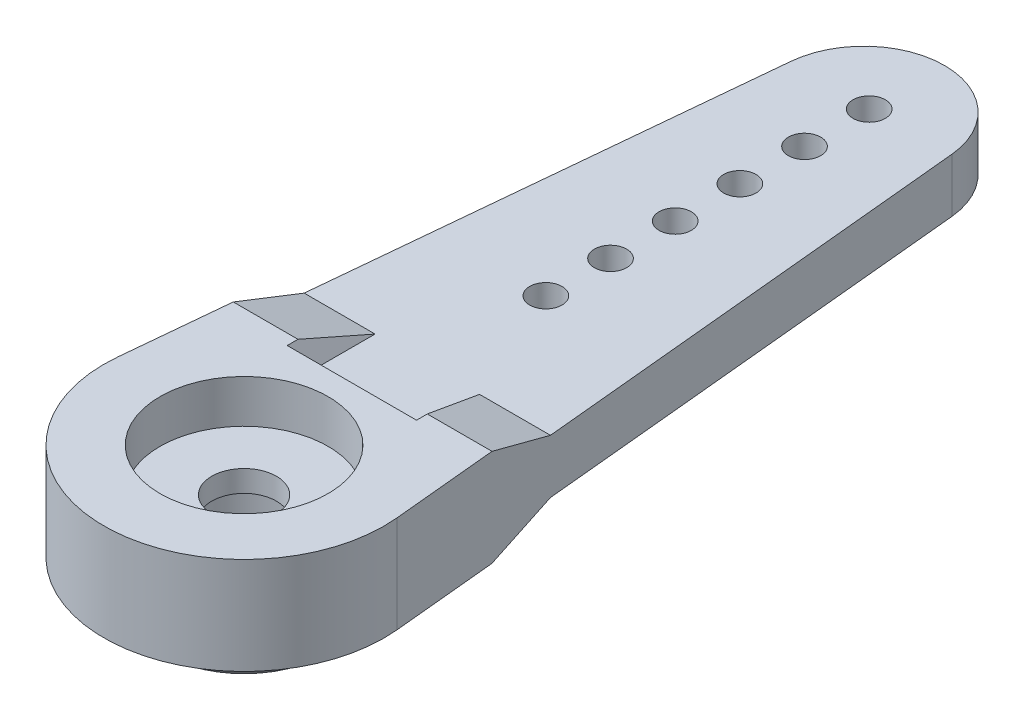
ISO-10303-21;
HEADER;
FILE_DESCRIPTION(('STEP AP214'),'2;1');
FILE_NAME('part.step','',(''),(''),'','','');
FILE_SCHEMA(('AUTOMOTIVE_DESIGN { 1 0 10303 214 1 1 1 1 }'));
ENDSEC;
DATA;
#1=APPLICATION_CONTEXT('core data for automotive mechanical design processes');
#2=APPLICATION_PROTOCOL_DEFINITION('international standard','automotive_design',2000,#1);
#3=PRODUCT_CONTEXT('',#1,'mechanical');
#4=PRODUCT('Part','Part','',(#3));
#5=PRODUCT_RELATED_PRODUCT_CATEGORY('part','',(#4));
#6=PRODUCT_DEFINITION_FORMATION('','',#4);
#7=PRODUCT_DEFINITION_CONTEXT('part definition',#1,'design');
#8=PRODUCT_DEFINITION('design','',#6,#7);
#9=PRODUCT_DEFINITION_SHAPE('','',#8);
#10=(LENGTH_UNIT() NAMED_UNIT(*) SI_UNIT(.MILLI.,.METRE.));
#11=(NAMED_UNIT(*) PLANE_ANGLE_UNIT() SI_UNIT($,.RADIAN.));
#12=(NAMED_UNIT(*) SI_UNIT($,.STERADIAN.) SOLID_ANGLE_UNIT());
#13=UNCERTAINTY_MEASURE_WITH_UNIT(LENGTH_MEASURE(1.E-05),#10,'distance_accuracy_value','');
#14=(GEOMETRIC_REPRESENTATION_CONTEXT(3) GLOBAL_UNCERTAINTY_ASSIGNED_CONTEXT((#13)) GLOBAL_UNIT_ASSIGNED_CONTEXT((#10,
#11,#12)) REPRESENTATION_CONTEXT('',''));
#15=CARTESIAN_POINT('',(0.,0.,0.));
#16=DIRECTION('',(0.,0.,1.));
#17=DIRECTION('',(1.,0.,0.));
#18=AXIS2_PLACEMENT_3D('',#15,#16,#17);
#19=CARTESIAN_POINT('',(0.,-2.25,0.));
#20=DIRECTION('',(0.,1.,0.));
#21=DIRECTION('',(0.,0.,1.));
#22=AXIS2_PLACEMENT_3D('',#19,#20,#21);
#23=PLANE('',#22);
#24=DIRECTION('',(0.,0.,1.));
#25=VECTOR('',#24,1.);
#26=CARTESIAN_POINT('',(-3.,-2.25,-5.));
#27=LINE('',#26,#25);
#28=CARTESIAN_POINT('',(-3.,-2.25,-5.5));
#29=VERTEX_POINT('',#28);
#30=CARTESIAN_POINT('',(-3.,-2.25,-5.));
#31=VERTEX_POINT('',#30);
#32=EDGE_CURVE('E183',#29,#31,#27,.T.);
#33=ORIENTED_EDGE('',*,*,#32,.T.);
#34=DIRECTION('',(1.,0.,0.));
#35=VECTOR('',#34,1.);
#36=CARTESIAN_POINT('',(-3.,-2.25,-5.));
#37=LINE('',#36,#35);
#38=CARTESIAN_POINT('',(3.,-2.25,-5.));
#39=VERTEX_POINT('',#38);
#40=EDGE_CURVE('E182',#31,#39,#37,.T.);
#41=ORIENTED_EDGE('',*,*,#40,.T.);
#42=DIRECTION('',(0.,0.,-1.));
#43=VECTOR('',#42,1.);
#44=CARTESIAN_POINT('',(3.,-2.25,-5.));
#45=LINE('',#44,#43);
#46=CARTESIAN_POINT('',(3.,-2.25,-5.5));
#47=VERTEX_POINT('',#46);
#48=EDGE_CURVE('E186',#39,#47,#45,.T.);
#49=ORIENTED_EDGE('',*,*,#48,.T.);
#50=DIRECTION('',(1.,0.,0.));
#51=VECTOR('',#50,1.);
#52=CARTESIAN_POINT('',(-7.,-2.25,-5.5));
#53=LINE('',#52,#51);
#54=CARTESIAN_POINT('',(6.00143069023298,-2.25,-5.49999999999999));
#55=VERTEX_POINT('',#54);
#56=EDGE_CURVE('E197',#47,#55,#53,.T.);
#57=ORIENTED_EDGE('',*,*,#56,.T.);
#58=DIRECTION('',(-0.0956521739130435,0.,-0.995414818869856));
#59=VECTOR('',#58,1.);
#60=CARTESIAN_POINT('',(3.73280557076196,-2.25,-29.1086956521739));
#61=LINE('',#60,#59);
#62=CARTESIAN_POINT('',(6.47019632265407,-2.25,-0.621739130434783));
#63=VERTEX_POINT('',#62);
#64=EDGE_CURVE('E376',#63,#55,#61,.T.);
#65=ORIENTED_EDGE('',*,*,#64,.F.);
#66=CARTESIAN_POINT('',(0.,-2.25,0.));
#67=DIRECTION('',(0.,1.,0.));
#68=DIRECTION('',(0.,0.,1.));
#69=AXIS2_PLACEMENT_3D('',#66,#67,#68);
#70=CIRCLE('',#69,6.5);
#71=CARTESIAN_POINT('',(-6.47019632265407,-2.25,-0.621739130434783));
#72=VERTEX_POINT('',#71);
#73=EDGE_CURVE('E363',#72,#63,#70,.T.);
#74=ORIENTED_EDGE('',*,*,#73,.F.);
#75=DIRECTION('',(-0.0956521739130435,0.,0.995414818869856));
#76=VECTOR('',#75,1.);
#77=CARTESIAN_POINT('',(-6.47019632265407,-2.25,-0.621739130434783));
#78=LINE('',#77,#76);
#79=CARTESIAN_POINT('',(-6.00143069023298,-2.25,-5.5));
#80=VERTEX_POINT('',#79);
#81=EDGE_CURVE('E368',#80,#72,#78,.T.);
#82=ORIENTED_EDGE('',*,*,#81,.F.);
#83=EDGE_CURVE('E297',#80,#29,#53,.T.);
#84=ORIENTED_EDGE('',*,*,#83,.T.);
#85=EDGE_LOOP('',(#33,#41,#49,#57,#65,#74,#82,#84));
#86=FACE_BOUND('',#85,.T.);
#87=CARTESIAN_POINT('',(0.,-2.25,0.));
#88=DIRECTION('',(0.,1.,0.));
#89=DIRECTION('',(0.,0.,1.));
#90=AXIS2_PLACEMENT_3D('',#87,#88,#89);
#91=CIRCLE('',#90,4.8);
#92=CARTESIAN_POINT('',(0.,-2.25,4.8));
#93=VERTEX_POINT('',#92);
#94=EDGE_CURVE('E192',#93,#93,#91,.F.);
#95=ORIENTED_EDGE('',*,*,#94,.F.);
#96=EDGE_LOOP('',(#95));
#97=FACE_BOUND('',#96,.T.);
#98=ADVANCED_FACE('F33',(#86,#97),#23,.F.);
#99=CARTESIAN_POINT('',(-7.,-1.25,-8.5));
#100=DIRECTION('',(0.,-0.948683298050514,-0.316227766016838));
#101=DIRECTION('',(0.,0.316227766016838,-0.948683298050514));
#102=AXIS2_PLACEMENT_3D('',#99,#100,#101);
#103=PLANE('',#102);
#104=DIRECTION('',(1.,0.,0.));
#105=VECTOR('',#104,1.);
#106=CARTESIAN_POINT('',(-7.,-1.25,-8.5));
#107=LINE('',#106,#105);
#108=CARTESIAN_POINT('',(-5.71315236013446,-1.25,-8.5));
#109=VERTEX_POINT('',#108);
#110=CARTESIAN_POINT('',(-2.42264973081037,-1.25,-8.5));
#111=VERTEX_POINT('',#110);
#112=EDGE_CURVE('E292',#109,#111,#107,.T.);
#113=ORIENTED_EDGE('',*,*,#112,.T.);
#114=DIRECTION('',(-0.179605302026775,-0.311085508419127,0.933256525257383));
#115=VECTOR('',#114,1.);
#116=CARTESIAN_POINT('',(-2.57030619110681,-1.50574849129921,-7.73275452610237));
#117=LINE('',#116,#115);
#118=EDGE_CURVE('E189',#111,#29,#117,.T.);
#119=ORIENTED_EDGE('',*,*,#118,.T.);
#120=ORIENTED_EDGE('',*,*,#83,.F.);
#121=DIRECTION('',(0.0907851605251029,0.314921903752094,-0.944765711256282));
#122=VECTOR('',#121,1.);
#123=CARTESIAN_POINT('',(-6.29505005335289,-3.26852734827328,-2.44441795518016));
#124=LINE('',#123,#122);
#125=EDGE_CURVE('E179',#80,#109,#124,.T.);
#126=ORIENTED_EDGE('',*,*,#125,.T.);
#127=EDGE_LOOP('',(#113,#119,#120,#126));
#128=FACE_BOUND('',#127,.T.);
#129=ADVANCED_FACE('F221',(#128),#103,.T.);
#130=ORIENTED_EDGE('',*,*,#56,.F.);
#131=DIRECTION('',(-0.179605302026775,0.311085508419127,-0.933256525257383));
#132=VECTOR('',#131,1.);
#133=CARTESIAN_POINT('',(2.11869328788101,-0.723531997558427,-10.0794040073247));
#134=LINE('',#133,#132);
#135=CARTESIAN_POINT('',(2.42264973081037,-1.25,-8.5));
#136=VERTEX_POINT('',#135);
#137=EDGE_CURVE('E193',#47,#136,#134,.T.);
#138=ORIENTED_EDGE('',*,*,#137,.T.);
#139=CARTESIAN_POINT('',(5.71315236013445,-1.25,-8.5));
#140=VERTEX_POINT('',#139);
#141=EDGE_CURVE('E296',#136,#140,#107,.T.);
#142=ORIENTED_EDGE('',*,*,#141,.T.);
#143=DIRECTION('',(0.0907851605251029,-0.314921903752094,0.944765711256282));
#144=VECTOR('',#143,1.);
#145=CARTESIAN_POINT('',(3.82914223414622,5.28538587289693,-28.1061576186908));
#146=LINE('',#145,#144);
#147=EDGE_CURVE('E322',#140,#55,#146,.T.);
#148=ORIENTED_EDGE('',*,*,#147,.T.);
#149=EDGE_LOOP('',(#130,#138,#142,#148));
#150=FACE_BOUND('',#149,.T.);
#151=ADVANCED_FACE('F227',(#150),#103,.T.);
#152=CARTESIAN_POINT('',(3.73280557076196,2.25,-29.1086956521739));
#153=DIRECTION('',(-0.995414818869856,0.,0.0956521739130435));
#154=DIRECTION('',(0.0956521739130435,0.,0.995414818869856));
#155=AXIS2_PLACEMENT_3D('',#152,#153,#154);
#156=PLANE('',#155);
#157=ORIENTED_EDGE('',*,*,#147,.F.);
#158=DIRECTION('',(0.0956521739130435,0.,0.995414818869856));
#159=VECTOR('',#158,1.);
#160=CARTESIAN_POINT('',(3.73280557076196,-1.25,-29.1086956521739));
#161=LINE('',#160,#159);
#162=CARTESIAN_POINT('',(3.73280557076196,-1.25,-29.1086956521739));
#163=VERTEX_POINT('',#162);
#164=EDGE_CURVE('E319',#163,#140,#161,.T.);
#165=ORIENTED_EDGE('',*,*,#164,.F.);
#166=DIRECTION('',(0.,-1.,0.));
#167=VECTOR('',#166,1.);
#168=CARTESIAN_POINT('',(3.73280557076196,2.25,-29.1086956521739));
#169=LINE('',#168,#167);
#170=CARTESIAN_POINT('',(3.73280557076196,1.25,-29.1086956521739));
#171=VERTEX_POINT('',#170);
#172=EDGE_CURVE('E385',#171,#163,#169,.T.);
#173=ORIENTED_EDGE('',*,*,#172,.F.);
#174=DIRECTION('',(0.0956521739130435,0.,0.995414818869856));
#175=VECTOR('',#174,1.);
#176=CARTESIAN_POINT('',(3.73280557076196,1.25,-29.1086956521739));
#177=LINE('',#176,#175);
#178=CARTESIAN_POINT('',(5.71315236013445,1.25,-8.5));
#179=VERTEX_POINT('',#178);
#180=EDGE_CURVE('E357',#171,#179,#177,.T.);
#181=ORIENTED_EDGE('',*,*,#180,.T.);
#182=DIRECTION('',(0.0907851605251029,0.314921903752094,0.944765711256282));
#183=VECTOR('',#182,1.);
#184=CARTESIAN_POINT('',(3.95779829427874,-4.83909474831414,-26.7672842449425));
#185=LINE('',#184,#183);
#186=CARTESIAN_POINT('',(6.00143069023298,2.25,-5.49999999999999));
#187=VERTEX_POINT('',#186);
#188=EDGE_CURVE('E360',#179,#187,#185,.T.);
#189=ORIENTED_EDGE('',*,*,#188,.T.);
#190=DIRECTION('',(-0.0956521739130435,0.,-0.995414818869856));
#191=VECTOR('',#190,1.);
#192=CARTESIAN_POINT('',(3.73280557076196,2.25,-29.1086956521739));
#193=LINE('',#192,#191);
#194=CARTESIAN_POINT('',(6.47019632265407,2.25,-0.621739130434783));
#195=VERTEX_POINT('',#194);
#196=EDGE_CURVE('E367',#195,#187,#193,.T.);
#197=ORIENTED_EDGE('',*,*,#196,.F.);
#198=DIRECTION('',(0.,-1.,0.));
#199=VECTOR('',#198,1.);
#200=CARTESIAN_POINT('',(6.47019632265407,2.25,-0.621739130434783));
#201=LINE('',#200,#199);
#202=EDGE_CURVE('E388',#195,#63,#201,.T.);
#203=ORIENTED_EDGE('',*,*,#202,.T.);
#204=ORIENTED_EDGE('',*,*,#64,.T.);
#205=EDGE_LOOP('',(#157,#165,#173,#181,#189,#197,#203,#204));
#206=FACE_BOUND('',#205,.T.);
#207=ADVANCED_FACE('F244',(#206),#156,.F.);
#208=CARTESIAN_POINT('',(0.,2.25,-28.75));
#209=DIRECTION('',(0.,-1.,0.));
#210=DIRECTION('',(0.,0.,-1.));
#211=AXIS2_PLACEMENT_3D('',#208,#209,#210);
#212=CYLINDRICAL_SURFACE('',#211,3.75);
#213=CARTESIAN_POINT('',(0.,-1.25,-28.75));
#214=DIRECTION('',(0.,-1.,0.));
#215=DIRECTION('',(0.,0.,-1.));
#216=AXIS2_PLACEMENT_3D('',#213,#214,#215);
#217=CIRCLE('',#216,3.75);
#218=CARTESIAN_POINT('',(-3.73280557076196,-1.25,-29.1086956521739));
#219=VERTEX_POINT('',#218);
#220=EDGE_CURVE('E317',#219,#163,#217,.T.);
#221=ORIENTED_EDGE('',*,*,#220,.F.);
#222=DIRECTION('',(0.,-1.,0.));
#223=VECTOR('',#222,1.);
#224=CARTESIAN_POINT('',(-3.73280557076196,2.25,-29.1086956521739));
#225=LINE('',#224,#223);
#226=CARTESIAN_POINT('',(-3.73280557076196,1.25,-29.1086956521739));
#227=VERTEX_POINT('',#226);
#228=EDGE_CURVE('E382',#227,#219,#225,.T.);
#229=ORIENTED_EDGE('',*,*,#228,.F.);
#230=CARTESIAN_POINT('',(0.,1.25,-28.75));
#231=DIRECTION('',(0.,-1.,0.));
#232=DIRECTION('',(0.,0.,-1.));
#233=AXIS2_PLACEMENT_3D('',#230,#231,#232);
#234=CIRCLE('',#233,3.75);
#235=EDGE_CURVE('E354',#227,#171,#234,.T.);
#236=ORIENTED_EDGE('',*,*,#235,.T.);
#237=ORIENTED_EDGE('',*,*,#172,.T.);
#238=EDGE_LOOP('',(#221,#229,#236,#237));
#239=FACE_BOUND('',#238,.T.);
#240=ADVANCED_FACE('F240',(#239),#212,.T.);
#241=CARTESIAN_POINT('',(-6.47019632265407,2.25,-0.621739130434783));
#242=DIRECTION('',(0.995414818869856,0.,0.0956521739130435));
#243=DIRECTION('',(0.0956521739130435,0.,-0.995414818869856));
#244=AXIS2_PLACEMENT_3D('',#241,#242,#243);
#245=PLANE('',#244);
#246=ORIENTED_EDGE('',*,*,#125,.F.);
#247=ORIENTED_EDGE('',*,*,#81,.T.);
#248=DIRECTION('',(0.,-1.,0.));
#249=VECTOR('',#248,1.);
#250=CARTESIAN_POINT('',(-6.47019632265407,2.25,-0.621739130434783));
#251=LINE('',#250,#249);
#252=CARTESIAN_POINT('',(-6.47019632265407,2.25,-0.621739130434783));
#253=VERTEX_POINT('',#252);
#254=EDGE_CURVE('E373',#253,#72,#251,.T.);
#255=ORIENTED_EDGE('',*,*,#254,.F.);
#256=DIRECTION('',(-0.0956521739130435,0.,0.995414818869856));
#257=VECTOR('',#256,1.);
#258=CARTESIAN_POINT('',(-6.47019632265407,2.25,-0.621739130434783));
#259=LINE('',#258,#257);
#260=CARTESIAN_POINT('',(-6.00143069023298,2.25,-5.5));
#261=VERTEX_POINT('',#260);
#262=EDGE_CURVE('E371',#261,#253,#259,.T.);
#263=ORIENTED_EDGE('',*,*,#262,.F.);
#264=DIRECTION('',(0.0907851605251029,-0.314921903752094,-0.944765711256282));
#265=VECTOR('',#264,1.);
#266=CARTESIAN_POINT('',(-6.42370611348541,3.71481847285607,-1.10554458143178));
#267=LINE('',#266,#265);
#268=CARTESIAN_POINT('',(-5.71315236013446,1.25,-8.5));
#269=VERTEX_POINT('',#268);
#270=EDGE_CURVE('E391',#261,#269,#267,.T.);
#271=ORIENTED_EDGE('',*,*,#270,.T.);
#272=DIRECTION('',(0.0956521739130435,0.,-0.995414818869856));
#273=VECTOR('',#272,1.);
#274=CARTESIAN_POINT('',(-6.47019632265407,1.25,-0.621739130434783));
#275=LINE('',#274,#273);
#276=EDGE_CURVE('E351',#269,#227,#275,.T.);
#277=ORIENTED_EDGE('',*,*,#276,.T.);
#278=ORIENTED_EDGE('',*,*,#228,.T.);
#279=DIRECTION('',(0.0956521739130435,0.,-0.995414818869856));
#280=VECTOR('',#279,1.);
#281=CARTESIAN_POINT('',(-6.47019632265407,-1.25,-0.621739130434782));
#282=LINE('',#281,#280);
#283=EDGE_CURVE('E314',#109,#219,#282,.T.);
#284=ORIENTED_EDGE('',*,*,#283,.F.);
#285=EDGE_LOOP('',(#246,#247,#255,#263,#271,#277,#278,#284));
#286=FACE_BOUND('',#285,.T.);
#287=ADVANCED_FACE('F236',(#286),#245,.F.);
#288=CARTESIAN_POINT('',(0.,2.25,-29.));
#289=DIRECTION('',(0.,-1.,0.));
#290=DIRECTION('',(0.,0.,-1.));
#291=AXIS2_PLACEMENT_3D('',#288,#289,#290);
#292=CYLINDRICAL_SURFACE('',#291,0.750000000000001);
#293=CARTESIAN_POINT('',(0.,1.25,-29.));
#294=DIRECTION('',(0.,-1.,0.));
#295=DIRECTION('',(0.,0.,-1.));
#296=AXIS2_PLACEMENT_3D('',#293,#294,#295);
#297=CIRCLE('',#296,0.750000000000001);
#298=CARTESIAN_POINT('',(0.,1.25,-29.75));
#299=VERTEX_POINT('',#298);
#300=EDGE_CURVE('E348',#299,#299,#297,.T.);
#301=ORIENTED_EDGE('',*,*,#300,.F.);
#302=EDGE_LOOP('',(#301));
#303=FACE_BOUND('',#302,.T.);
#304=CARTESIAN_POINT('',(0.,-1.25,-29.));
#305=DIRECTION('',(0.,-1.,0.));
#306=DIRECTION('',(0.,0.,-1.));
#307=AXIS2_PLACEMENT_3D('',#304,#305,#306);
#308=CIRCLE('',#307,0.750000000000001);
#309=CARTESIAN_POINT('',(0.,-1.25,-29.75));
#310=VERTEX_POINT('',#309);
#311=EDGE_CURVE('E311',#310,#310,#308,.T.);
#312=ORIENTED_EDGE('',*,*,#311,.T.);
#313=EDGE_LOOP('',(#312));
#314=FACE_BOUND('',#313,.T.);
#315=ADVANCED_FACE('F239',(#303,#314),#292,.F.);
#316=CARTESIAN_POINT('',(0.,2.25,-26.));
#317=DIRECTION('',(0.,-1.,0.));
#318=DIRECTION('',(0.,0.,-1.));
#319=AXIS2_PLACEMENT_3D('',#316,#317,#318);
#320=CYLINDRICAL_SURFACE('',#319,0.750000000000001);
#321=CARTESIAN_POINT('',(0.,1.25,-26.));
#322=DIRECTION('',(0.,-1.,0.));
#323=DIRECTION('',(0.,0.,-1.));
#324=AXIS2_PLACEMENT_3D('',#321,#322,#323);
#325=CIRCLE('',#324,0.750000000000001);
#326=CARTESIAN_POINT('',(0.,1.25,-26.75));
#327=VERTEX_POINT('',#326);
#328=EDGE_CURVE('E345',#327,#327,#325,.T.);
#329=ORIENTED_EDGE('',*,*,#328,.F.);
#330=EDGE_LOOP('',(#329));
#331=FACE_BOUND('',#330,.T.);
#332=CARTESIAN_POINT('',(0.,-1.25,-26.));
#333=DIRECTION('',(0.,-1.,0.));
#334=DIRECTION('',(0.,0.,-1.));
#335=AXIS2_PLACEMENT_3D('',#332,#333,#334);
#336=CIRCLE('',#335,0.750000000000001);
#337=CARTESIAN_POINT('',(0.,-1.25,-26.75));
#338=VERTEX_POINT('',#337);
#339=EDGE_CURVE('E308',#338,#338,#336,.T.);
#340=ORIENTED_EDGE('',*,*,#339,.T.);
#341=EDGE_LOOP('',(#340));
#342=FACE_BOUND('',#341,.T.);
#343=ADVANCED_FACE('F449',(#331,#342),#320,.F.);
#344=CARTESIAN_POINT('',(0.,2.25,-23.));
#345=DIRECTION('',(0.,-1.,0.));
#346=DIRECTION('',(0.,0.,-1.));
#347=AXIS2_PLACEMENT_3D('',#344,#345,#346);
#348=CYLINDRICAL_SURFACE('',#347,0.750000000000001);
#349=CARTESIAN_POINT('',(0.,1.25,-23.));
#350=DIRECTION('',(0.,-1.,0.));
#351=DIRECTION('',(0.,0.,-1.));
#352=AXIS2_PLACEMENT_3D('',#349,#350,#351);
#353=CIRCLE('',#352,0.750000000000001);
#354=CARTESIAN_POINT('',(0.,1.25,-23.75));
#355=VERTEX_POINT('',#354);
#356=EDGE_CURVE('E342',#355,#355,#353,.T.);
#357=ORIENTED_EDGE('',*,*,#356,.F.);
#358=EDGE_LOOP('',(#357));
#359=FACE_BOUND('',#358,.T.);
#360=CARTESIAN_POINT('',(0.,-1.25,-23.));
#361=DIRECTION('',(0.,-1.,0.));
#362=DIRECTION('',(0.,0.,-1.));
#363=AXIS2_PLACEMENT_3D('',#360,#361,#362);
#364=CIRCLE('',#363,0.750000000000001);
#365=CARTESIAN_POINT('',(0.,-1.25,-23.75));
#366=VERTEX_POINT('',#365);
#367=EDGE_CURVE('E305',#366,#366,#364,.T.);
#368=ORIENTED_EDGE('',*,*,#367,.T.);
#369=EDGE_LOOP('',(#368));
#370=FACE_BOUND('',#369,.T.);
#371=ADVANCED_FACE('F445',(#359,#370),#348,.F.);
#372=CARTESIAN_POINT('',(0.,2.25,-20.));
#373=DIRECTION('',(0.,-1.,0.));
#374=DIRECTION('',(0.,0.,-1.));
#375=AXIS2_PLACEMENT_3D('',#372,#373,#374);
#376=CYLINDRICAL_SURFACE('',#375,0.750000000000001);
#377=CARTESIAN_POINT('',(0.,1.25,-20.));
#378=DIRECTION('',(0.,-1.,0.));
#379=DIRECTION('',(0.,0.,-1.));
#380=AXIS2_PLACEMENT_3D('',#377,#378,#379);
#381=CIRCLE('',#380,0.750000000000001);
#382=CARTESIAN_POINT('',(0.,1.25,-20.75));
#383=VERTEX_POINT('',#382);
#384=EDGE_CURVE('E339',#383,#383,#381,.T.);
#385=ORIENTED_EDGE('',*,*,#384,.F.);
#386=EDGE_LOOP('',(#385));
#387=FACE_BOUND('',#386,.T.);
#388=CARTESIAN_POINT('',(0.,-1.25,-20.));
#389=DIRECTION('',(0.,-1.,0.));
#390=DIRECTION('',(0.,0.,-1.));
#391=AXIS2_PLACEMENT_3D('',#388,#389,#390);
#392=CIRCLE('',#391,0.750000000000001);
#393=CARTESIAN_POINT('',(0.,-1.25,-20.75));
#394=VERTEX_POINT('',#393);
#395=EDGE_CURVE('E302',#394,#394,#392,.T.);
#396=ORIENTED_EDGE('',*,*,#395,.T.);
#397=EDGE_LOOP('',(#396));
#398=FACE_BOUND('',#397,.T.);
#399=ADVANCED_FACE('F441',(#387,#398),#376,.F.);
#400=CARTESIAN_POINT('',(0.,2.25,-17.));
#401=DIRECTION('',(0.,-1.,0.));
#402=DIRECTION('',(0.,0.,-1.));
#403=AXIS2_PLACEMENT_3D('',#400,#401,#402);
#404=CYLINDRICAL_SURFACE('',#403,0.750000000000001);
#405=CARTESIAN_POINT('',(0.,1.25,-17.));
#406=DIRECTION('',(0.,-1.,0.));
#407=DIRECTION('',(0.,0.,-1.));
#408=AXIS2_PLACEMENT_3D('',#405,#406,#407);
#409=CIRCLE('',#408,0.750000000000001);
#410=CARTESIAN_POINT('',(0.,1.25,-17.75));
#411=VERTEX_POINT('',#410);
#412=EDGE_CURVE('E336',#411,#411,#409,.T.);
#413=ORIENTED_EDGE('',*,*,#412,.F.);
#414=EDGE_LOOP('',(#413));
#415=FACE_BOUND('',#414,.T.);
#416=CARTESIAN_POINT('',(0.,-1.25,-17.));
#417=DIRECTION('',(0.,-1.,0.));
#418=DIRECTION('',(0.,0.,-1.));
#419=AXIS2_PLACEMENT_3D('',#416,#417,#418);
#420=CIRCLE('',#419,0.750000000000001);
#421=CARTESIAN_POINT('',(0.,-1.25,-17.75));
#422=VERTEX_POINT('',#421);
#423=EDGE_CURVE('E299',#422,#422,#420,.T.);
#424=ORIENTED_EDGE('',*,*,#423,.T.);
#425=EDGE_LOOP('',(#424));
#426=FACE_BOUND('',#425,.T.);
#427=ADVANCED_FACE('F437',(#415,#426),#404,.F.);
#428=CARTESIAN_POINT('',(0.,2.25,-14.));
#429=DIRECTION('',(0.,-1.,0.));
#430=DIRECTION('',(0.,0.,-1.));
#431=AXIS2_PLACEMENT_3D('',#428,#429,#430);
#432=CYLINDRICAL_SURFACE('',#431,0.750000000000001);
#433=CARTESIAN_POINT('',(0.,1.25,-14.));
#434=DIRECTION('',(0.,-1.,0.));
#435=DIRECTION('',(0.,0.,-1.));
#436=AXIS2_PLACEMENT_3D('',#433,#434,#435);
#437=CIRCLE('',#436,0.750000000000001);
#438=CARTESIAN_POINT('',(0.,1.25,-14.75));
#439=VERTEX_POINT('',#438);
#440=EDGE_CURVE('E331',#439,#439,#437,.T.);
#441=ORIENTED_EDGE('',*,*,#440,.F.);
#442=EDGE_LOOP('',(#441));
#443=FACE_BOUND('',#442,.T.);
#444=CARTESIAN_POINT('',(0.,-1.25,-14.));
#445=DIRECTION('',(0.,-1.,0.));
#446=DIRECTION('',(0.,0.,-1.));
#447=AXIS2_PLACEMENT_3D('',#444,#445,#446);
#448=CIRCLE('',#447,0.750000000000001);
#449=CARTESIAN_POINT('',(0.,-1.25,-14.75));
#450=VERTEX_POINT('',#449);
#451=EDGE_CURVE('E295',#450,#450,#448,.T.);
#452=ORIENTED_EDGE('',*,*,#451,.T.);
#453=EDGE_LOOP('',(#452));
#454=FACE_BOUND('',#453,.T.);
#455=ADVANCED_FACE('F434',(#443,#454),#432,.F.);
#456=CARTESIAN_POINT('',(-7.,1.25,-8.5));
#457=DIRECTION('',(0.,-0.948683298050514,0.316227766016838));
#458=DIRECTION('',(0.,-0.316227766016838,-0.948683298050514));
#459=AXIS2_PLACEMENT_3D('',#456,#457,#458);
#460=PLANE('',#459);
#461=DIRECTION('',(1.,0.,0.));
#462=VECTOR('',#461,1.);
#463=CARTESIAN_POINT('',(-7.,1.25,-8.5));
#464=LINE('',#463,#462);
#465=CARTESIAN_POINT('',(2.42264973081037,1.25,-8.5));
#466=VERTEX_POINT('',#465);
#467=EDGE_CURVE('E335',#466,#179,#464,.T.);
#468=ORIENTED_EDGE('',*,*,#467,.F.);
#469=DIRECTION('',(-0.179605302026775,-0.311085508419127,-0.933256525257383));
#470=VECTOR('',#469,1.);
#471=CARTESIAN_POINT('',(2.11869328788101,0.723531997558428,-10.0794040073247));
#472=LINE('',#471,#470);
#473=CARTESIAN_POINT('',(3.,2.25,-5.5));
#474=VERTEX_POINT('',#473);
#475=EDGE_CURVE('E154',#466,#474,#472,.F.);
#476=ORIENTED_EDGE('',*,*,#475,.T.);
#477=DIRECTION('',(1.,0.,0.));
#478=VECTOR('',#477,1.);
#479=CARTESIAN_POINT('',(-7.,2.25,-5.5));
#480=LINE('',#479,#478);
#481=EDGE_CURVE('E332',#474,#187,#480,.T.);
#482=ORIENTED_EDGE('',*,*,#481,.T.);
#483=ORIENTED_EDGE('',*,*,#188,.F.);
#484=EDGE_LOOP('',(#468,#476,#482,#483));
#485=FACE_BOUND('',#484,.T.);
#486=ADVANCED_FACE('F420',(#485),#460,.F.);
#487=CARTESIAN_POINT('',(0.,2.25,0.));
#488=DIRECTION('',(0.,1.,0.));
#489=DIRECTION('',(0.,0.,1.));
#490=AXIS2_PLACEMENT_3D('',#487,#488,#489);
#491=PLANE('',#490);
#492=CARTESIAN_POINT('',(0.,2.25,0.));
#493=DIRECTION('',(0.,1.,0.));
#494=DIRECTION('',(0.,0.,1.));
#495=AXIS2_PLACEMENT_3D('',#492,#493,#494);
#496=CIRCLE('',#495,3.9);
#497=CARTESIAN_POINT('',(0.,2.25,3.9));
#498=VERTEX_POINT('',#497);
#499=EDGE_CURVE('E287',#498,#498,#496,.T.);
#500=ORIENTED_EDGE('',*,*,#499,.F.);
#501=EDGE_LOOP('',(#500));
#502=FACE_BOUND('',#501,.T.);
#503=DIRECTION('',(0.,0.,-1.));
#504=VECTOR('',#503,1.);
#505=CARTESIAN_POINT('',(3.,2.25,-5.));
#506=LINE('',#505,#504);
#507=CARTESIAN_POINT('',(3.,2.25,-5.));
#508=VERTEX_POINT('',#507);
#509=EDGE_CURVE('E172',#508,#474,#506,.T.);
#510=ORIENTED_EDGE('',*,*,#509,.F.);
#511=DIRECTION('',(1.,0.,0.));
#512=VECTOR('',#511,1.);
#513=CARTESIAN_POINT('',(-3.,2.25,-5.));
#514=LINE('',#513,#512);
#515=CARTESIAN_POINT('',(-3.,2.25,-5.));
#516=VERTEX_POINT('',#515);
#517=EDGE_CURVE('E166',#516,#508,#514,.T.);
#518=ORIENTED_EDGE('',*,*,#517,.F.);
#519=DIRECTION('',(0.,0.,1.));
#520=VECTOR('',#519,1.);
#521=CARTESIAN_POINT('',(-3.,2.25,-5.));
#522=LINE('',#521,#520);
#523=CARTESIAN_POINT('',(-3.,2.25,-5.5));
#524=VERTEX_POINT('',#523);
#525=EDGE_CURVE('E324',#524,#516,#522,.T.);
#526=ORIENTED_EDGE('',*,*,#525,.F.);
#527=EDGE_CURVE('E328',#261,#524,#480,.T.);
#528=ORIENTED_EDGE('',*,*,#527,.F.);
#529=ORIENTED_EDGE('',*,*,#262,.T.);
#530=CARTESIAN_POINT('',(0.,2.25,0.));
#531=DIRECTION('',(0.,1.,0.));
#532=DIRECTION('',(0.,0.,1.));
#533=AXIS2_PLACEMENT_3D('',#530,#531,#532);
#534=CIRCLE('',#533,6.5);
#535=EDGE_CURVE('E364',#253,#195,#534,.T.);
#536=ORIENTED_EDGE('',*,*,#535,.T.);
#537=ORIENTED_EDGE('',*,*,#196,.T.);
#538=ORIENTED_EDGE('',*,*,#481,.F.);
#539=EDGE_LOOP('',(#510,#518,#526,#528,#529,#536,#537,#538));
#540=FACE_BOUND('',#539,.T.);
#541=ADVANCED_FACE('F234',(#502,#540),#491,.T.);
#542=CARTESIAN_POINT('',(0.,2.25,0.));
#543=DIRECTION('',(0.,-1.,0.));
#544=DIRECTION('',(0.,0.,-1.));
#545=AXIS2_PLACEMENT_3D('',#542,#543,#544);
#546=CYLINDRICAL_SURFACE('',#545,6.5);
#547=ORIENTED_EDGE('',*,*,#73,.T.);
#548=ORIENTED_EDGE('',*,*,#202,.F.);
#549=ORIENTED_EDGE('',*,*,#535,.F.);
#550=ORIENTED_EDGE('',*,*,#254,.T.);
#551=EDGE_LOOP('',(#547,#548,#549,#550));
#552=FACE_BOUND('',#551,.T.);
#553=ADVANCED_FACE('F249',(#552),#546,.T.);
#554=ORIENTED_EDGE('',*,*,#527,.T.);
#555=DIRECTION('',(-0.179605302026775,0.311085508419127,0.933256525257383));
#556=VECTOR('',#555,1.);
#557=CARTESIAN_POINT('',(-2.57030619110681,1.50574849129921,-7.73275452610237));
#558=LINE('',#557,#556);
#559=CARTESIAN_POINT('',(-2.42264973081037,1.25,-8.5));
#560=VERTEX_POINT('',#559);
#561=EDGE_CURVE('E180',#524,#560,#558,.F.);
#562=ORIENTED_EDGE('',*,*,#561,.T.);
#563=EDGE_CURVE('E333',#269,#560,#464,.T.);
#564=ORIENTED_EDGE('',*,*,#563,.F.);
#565=ORIENTED_EDGE('',*,*,#270,.F.);
#566=EDGE_LOOP('',(#554,#562,#564,#565));
#567=FACE_BOUND('',#566,.T.);
#568=ADVANCED_FACE('F252',(#567),#460,.F.);
#569=CARTESIAN_POINT('',(-7.,1.25,-32.5));
#570=DIRECTION('',(0.,-1.,0.));
#571=DIRECTION('',(0.,0.,-1.));
#572=AXIS2_PLACEMENT_3D('',#569,#570,#571);
#573=PLANE('',#572);
#574=ORIENTED_EDGE('',*,*,#300,.T.);
#575=EDGE_LOOP('',(#574));
#576=FACE_BOUND('',#575,.T.);
#577=ORIENTED_EDGE('',*,*,#328,.T.);
#578=EDGE_LOOP('',(#577));
#579=FACE_BOUND('',#578,.T.);
#580=ORIENTED_EDGE('',*,*,#356,.T.);
#581=EDGE_LOOP('',(#580));
#582=FACE_BOUND('',#581,.T.);
#583=ORIENTED_EDGE('',*,*,#384,.T.);
#584=EDGE_LOOP('',(#583));
#585=FACE_BOUND('',#584,.T.);
#586=ORIENTED_EDGE('',*,*,#412,.T.);
#587=EDGE_LOOP('',(#586));
#588=FACE_BOUND('',#587,.T.);
#589=ORIENTED_EDGE('',*,*,#440,.T.);
#590=EDGE_LOOP('',(#589));
#591=FACE_BOUND('',#590,.T.);
#592=ORIENTED_EDGE('',*,*,#235,.F.);
#593=ORIENTED_EDGE('',*,*,#276,.F.);
#594=ORIENTED_EDGE('',*,*,#563,.T.);
#595=DIRECTION('',(0.,0.,-1.));
#596=VECTOR('',#595,1.);
#597=CARTESIAN_POINT('',(-2.42264973081037,1.25,-5.));
#598=LINE('',#597,#596);
#599=CARTESIAN_POINT('',(-2.42264973081037,1.25,-5.57735026918963));
#600=VERTEX_POINT('',#599);
#601=EDGE_CURVE('E158',#560,#600,#598,.F.);
#602=ORIENTED_EDGE('',*,*,#601,.T.);
#603=DIRECTION('',(-1.,0.,0.));
#604=VECTOR('',#603,1.);
#605=CARTESIAN_POINT('',(-3.,1.25,-5.57735026918963));
#606=LINE('',#605,#604);
#607=CARTESIAN_POINT('',(2.42264973081037,1.25,-5.57735026918963));
#608=VERTEX_POINT('',#607);
#609=EDGE_CURVE('E163',#600,#608,#606,.F.);
#610=ORIENTED_EDGE('',*,*,#609,.T.);
#611=DIRECTION('',(0.,0.,1.));
#612=VECTOR('',#611,1.);
#613=CARTESIAN_POINT('',(2.42264973081037,1.25,-5.));
#614=LINE('',#613,#612);
#615=EDGE_CURVE('E148',#608,#466,#614,.F.);
#616=ORIENTED_EDGE('',*,*,#615,.T.);
#617=ORIENTED_EDGE('',*,*,#467,.T.);
#618=ORIENTED_EDGE('',*,*,#180,.F.);
#619=EDGE_LOOP('',(#592,#593,#594,#602,#610,#616,#617,#618));
#620=FACE_BOUND('',#619,.T.);
#621=ADVANCED_FACE('F169',(#576,#579,#582,#585,#588,#591,#620),#573,.F.);
#622=CARTESIAN_POINT('',(3.,2.25,-5.));
#623=DIRECTION('',(-0.866025403784438,0.500000000000001,0.));
#624=DIRECTION('',(-0.500000000000001,-0.866025403784438,0.));
#625=AXIS2_PLACEMENT_3D('',#622,#623,#624);
#626=PLANE('',#625);
#627=ORIENTED_EDGE('',*,*,#615,.F.);
#628=DIRECTION('',(0.447213595499958,0.774596669241483,0.447213595499958));
#629=VECTOR('',#628,1.);
#630=CARTESIAN_POINT('',(1.8,0.171539030917347,-6.2));
#631=LINE('',#630,#629);
#632=EDGE_CURVE('E151',#608,#508,#631,.T.);
#633=ORIENTED_EDGE('',*,*,#632,.T.);
#634=ORIENTED_EDGE('',*,*,#509,.T.);
#635=ORIENTED_EDGE('',*,*,#475,.F.);
#636=EDGE_LOOP('',(#627,#633,#634,#635));
#637=FACE_BOUND('',#636,.T.);
#638=ADVANCED_FACE('F150',(#637),#626,.T.);
#639=CARTESIAN_POINT('',(-3.,2.25,-5.));
#640=DIRECTION('',(0.866025403784438,0.500000000000001,0.));
#641=DIRECTION('',(-0.500000000000001,0.866025403784438,0.));
#642=AXIS2_PLACEMENT_3D('',#639,#640,#641);
#643=PLANE('',#642);
#644=ORIENTED_EDGE('',*,*,#525,.T.);
#645=DIRECTION('',(-0.447213595499958,0.774596669241483,0.447213595499958));
#646=VECTOR('',#645,1.);
#647=CARTESIAN_POINT('',(-3.,2.25,-5.));
#648=LINE('',#647,#646);
#649=EDGE_CURVE('E400',#600,#516,#648,.T.);
#650=ORIENTED_EDGE('',*,*,#649,.F.);
#651=ORIENTED_EDGE('',*,*,#601,.F.);
#652=ORIENTED_EDGE('',*,*,#561,.F.);
#653=EDGE_LOOP('',(#644,#650,#651,#652));
#654=FACE_BOUND('',#653,.T.);
#655=ADVANCED_FACE('F257',(#654),#643,.T.);
#656=CARTESIAN_POINT('',(-3.,2.25,-5.));
#657=DIRECTION('',(0.,0.500000000000001,-0.866025403784438));
#658=DIRECTION('',(0.,0.866025403784438,0.500000000000001));
#659=AXIS2_PLACEMENT_3D('',#656,#657,#658);
#660=PLANE('',#659);
#661=ORIENTED_EDGE('',*,*,#649,.T.);
#662=ORIENTED_EDGE('',*,*,#517,.T.);
#663=ORIENTED_EDGE('',*,*,#632,.F.);
#664=ORIENTED_EDGE('',*,*,#609,.F.);
#665=EDGE_LOOP('',(#661,#662,#663,#664));
#666=FACE_BOUND('',#665,.T.);
#667=ADVANCED_FACE('F162',(#666),#660,.T.);
#668=CARTESIAN_POINT('',(-7.,-1.25,-32.5));
#669=DIRECTION('',(0.,-1.,0.));
#670=DIRECTION('',(0.,0.,-1.));
#671=AXIS2_PLACEMENT_3D('',#668,#669,#670);
#672=PLANE('',#671);
#673=ORIENTED_EDGE('',*,*,#311,.F.);
#674=EDGE_LOOP('',(#673));
#675=FACE_BOUND('',#674,.T.);
#676=ORIENTED_EDGE('',*,*,#339,.F.);
#677=EDGE_LOOP('',(#676));
#678=FACE_BOUND('',#677,.T.);
#679=ORIENTED_EDGE('',*,*,#367,.F.);
#680=EDGE_LOOP('',(#679));
#681=FACE_BOUND('',#680,.T.);
#682=ORIENTED_EDGE('',*,*,#395,.F.);
#683=EDGE_LOOP('',(#682));
#684=FACE_BOUND('',#683,.T.);
#685=ORIENTED_EDGE('',*,*,#423,.F.);
#686=EDGE_LOOP('',(#685));
#687=FACE_BOUND('',#686,.T.);
#688=ORIENTED_EDGE('',*,*,#451,.F.);
#689=EDGE_LOOP('',(#688));
#690=FACE_BOUND('',#689,.T.);
#691=ORIENTED_EDGE('',*,*,#164,.T.);
#692=ORIENTED_EDGE('',*,*,#141,.F.);
#693=DIRECTION('',(0.,0.,-1.));
#694=VECTOR('',#693,1.);
#695=CARTESIAN_POINT('',(2.42264973081038,-1.25,-32.5));
#696=LINE('',#695,#694);
#697=CARTESIAN_POINT('',(2.42264973081037,-1.25,-5.57735026918963));
#698=VERTEX_POINT('',#697);
#699=EDGE_CURVE('E65',#698,#136,#696,.T.);
#700=ORIENTED_EDGE('',*,*,#699,.F.);
#701=DIRECTION('',(1.,0.,0.));
#702=VECTOR('',#701,1.);
#703=CARTESIAN_POINT('',(-7.,-1.25,-5.57735026918963));
#704=LINE('',#703,#702);
#705=CARTESIAN_POINT('',(-2.42264973081037,-1.25,-5.57735026918963));
#706=VERTEX_POINT('',#705);
#707=EDGE_CURVE('E188',#706,#698,#704,.T.);
#708=ORIENTED_EDGE('',*,*,#707,.F.);
#709=DIRECTION('',(0.,0.,1.));
#710=VECTOR('',#709,1.);
#711=CARTESIAN_POINT('',(-2.42264973081038,-1.25,-32.5));
#712=LINE('',#711,#710);
#713=EDGE_CURVE('E50',#111,#706,#712,.T.);
#714=ORIENTED_EDGE('',*,*,#713,.F.);
#715=ORIENTED_EDGE('',*,*,#112,.F.);
#716=ORIENTED_EDGE('',*,*,#283,.T.);
#717=ORIENTED_EDGE('',*,*,#220,.T.);
#718=EDGE_LOOP('',(#691,#692,#700,#708,#714,#715,#716,#717));
#719=FACE_BOUND('',#718,.T.);
#720=ADVANCED_FACE('F256',(#675,#678,#681,#684,#687,#690,#719),#672,.T.);
#721=CARTESIAN_POINT('',(-3.,-2.25,-5.));
#722=DIRECTION('',(0.866025403784438,-0.500000000000001,0.));
#723=DIRECTION('',(0.500000000000001,0.866025403784438,0.));
#724=AXIS2_PLACEMENT_3D('',#721,#722,#723);
#725=PLANE('',#724);
#726=ORIENTED_EDGE('',*,*,#713,.T.);
#727=DIRECTION('',(-0.447213595499959,-0.774596669241482,0.447213595499959));
#728=VECTOR('',#727,1.);
#729=CARTESIAN_POINT('',(-3.,-2.25,-5.));
#730=LINE('',#729,#728);
#731=EDGE_CURVE('E74',#706,#31,#730,.T.);
#732=ORIENTED_EDGE('',*,*,#731,.T.);
#733=ORIENTED_EDGE('',*,*,#32,.F.);
#734=ORIENTED_EDGE('',*,*,#118,.F.);
#735=EDGE_LOOP('',(#726,#732,#733,#734));
#736=FACE_BOUND('',#735,.T.);
#737=ADVANCED_FACE('F263',(#736),#725,.T.);
#738=CARTESIAN_POINT('',(-3.,-2.25,-5.));
#739=DIRECTION('',(0.,-0.500000000000001,-0.866025403784438));
#740=DIRECTION('',(0.,0.866025403784438,-0.500000000000001));
#741=AXIS2_PLACEMENT_3D('',#738,#739,#740);
#742=PLANE('',#741);
#743=ORIENTED_EDGE('',*,*,#707,.T.);
#744=DIRECTION('',(0.447213595499959,-0.774596669241482,0.447213595499959));
#745=VECTOR('',#744,1.);
#746=CARTESIAN_POINT('',(3.,-2.25,-5.));
#747=LINE('',#746,#745);
#748=EDGE_CURVE('E184',#698,#39,#747,.T.);
#749=ORIENTED_EDGE('',*,*,#748,.T.);
#750=ORIENTED_EDGE('',*,*,#40,.F.);
#751=ORIENTED_EDGE('',*,*,#731,.F.);
#752=EDGE_LOOP('',(#743,#749,#750,#751));
#753=FACE_BOUND('',#752,.T.);
#754=ADVANCED_FACE('F266',(#753),#742,.T.);
#755=CARTESIAN_POINT('',(3.,-2.25,-5.));
#756=DIRECTION('',(-0.866025403784438,-0.500000000000001,0.));
#757=DIRECTION('',(0.500000000000001,-0.866025403784438,0.));
#758=AXIS2_PLACEMENT_3D('',#755,#756,#757);
#759=PLANE('',#758);
#760=ORIENTED_EDGE('',*,*,#48,.F.);
#761=ORIENTED_EDGE('',*,*,#748,.F.);
#762=ORIENTED_EDGE('',*,*,#699,.T.);
#763=ORIENTED_EDGE('',*,*,#137,.F.);
#764=EDGE_LOOP('',(#760,#761,#762,#763));
#765=FACE_BOUND('',#764,.T.);
#766=ADVANCED_FACE('F268',(#765),#759,.T.);
#767=CARTESIAN_POINT('',(0.,0.25,0.));
#768=DIRECTION('',(0.,1.,0.));
#769=DIRECTION('',(0.,0.,1.));
#770=AXIS2_PLACEMENT_3D('',#767,#768,#769);
#771=CYLINDRICAL_SURFACE('',#770,3.9);
#772=CARTESIAN_POINT('',(0.,0.25,0.));
#773=DIRECTION('',(0.,1.,0.));
#774=DIRECTION('',(0.,0.,1.));
#775=AXIS2_PLACEMENT_3D('',#772,#773,#774);
#776=CIRCLE('',#775,3.9);
#777=CARTESIAN_POINT('',(0.,0.25,3.9));
#778=VERTEX_POINT('',#777);
#779=EDGE_CURVE('E291',#778,#778,#776,.T.);
#780=ORIENTED_EDGE('',*,*,#779,.F.);
#781=EDGE_LOOP('',(#780));
#782=FACE_BOUND('',#781,.T.);
#783=ORIENTED_EDGE('',*,*,#499,.T.);
#784=EDGE_LOOP('',(#783));
#785=FACE_BOUND('',#784,.T.);
#786=ADVANCED_FACE('F271',(#782,#785),#771,.F.);
#787=CARTESIAN_POINT('',(0.,0.25,0.));
#788=DIRECTION('',(0.,1.,0.));
#789=DIRECTION('',(0.,0.,1.));
#790=AXIS2_PLACEMENT_3D('',#787,#788,#789);
#791=PLANE('',#790);
#792=CARTESIAN_POINT('',(0.,0.25,0.));
#793=DIRECTION('',(0.,1.,0.));
#794=DIRECTION('',(0.,0.,1.));
#795=AXIS2_PLACEMENT_3D('',#792,#793,#794);
#796=CIRCLE('',#795,1.5);
#797=CARTESIAN_POINT('',(0.,0.25,1.5));
#798=VERTEX_POINT('',#797);
#799=EDGE_CURVE('E573',#798,#798,#796,.T.);
#800=ORIENTED_EDGE('',*,*,#799,.F.);
#801=EDGE_LOOP('',(#800));
#802=FACE_BOUND('',#801,.T.);
#803=ORIENTED_EDGE('',*,*,#779,.T.);
#804=EDGE_LOOP('',(#803));
#805=FACE_BOUND('',#804,.T.);
#806=ADVANCED_FACE('F276',(#802,#805),#791,.T.);
#807=CARTESIAN_POINT('',(0.,-4.25,0.));
#808=DIRECTION('',(0.,1.,0.));
#809=DIRECTION('',(0.,0.,1.));
#810=AXIS2_PLACEMENT_3D('',#807,#808,#809);
#811=CYLINDRICAL_SURFACE('',#810,4.8);
#812=CARTESIAN_POINT('',(0.,-3.25,0.));
#813=DIRECTION('',(0.,-1.,0.));
#814=DIRECTION('',(0.,0.,-1.));
#815=AXIS2_PLACEMENT_3D('',#812,#813,#814);
#816=CIRCLE('',#815,4.8);
#817=CARTESIAN_POINT('',(0.,-3.25,-4.8));
#818=VERTEX_POINT('',#817);
#819=EDGE_CURVE('E11',#818,#818,#816,.F.);
#820=ORIENTED_EDGE('',*,*,#819,.T.);
#821=EDGE_LOOP('',(#820));
#822=FACE_BOUND('',#821,.T.);
#823=ORIENTED_EDGE('',*,*,#94,.T.);
#824=EDGE_LOOP('',(#823));
#825=FACE_BOUND('',#824,.T.);
#826=ADVANCED_FACE('F216',(#822,#825),#811,.T.);
#827=CARTESIAN_POINT('',(0.,-4.25,0.));
#828=DIRECTION('',(0.,-1.,0.));
#829=DIRECTION('',(0.,0.,-1.));
#830=AXIS2_PLACEMENT_3D('',#827,#828,#829);
#831=PLANE('',#830);
#832=CARTESIAN_POINT('',(0.,-4.25,0.));
#833=DIRECTION('',(0.,-1.,0.));
#834=DIRECTION('',(0.,0.,-1.));
#835=AXIS2_PLACEMENT_3D('',#832,#833,#834);
#836=CIRCLE('',#835,3.);
#837=CARTESIAN_POINT('',(0.,-4.25,-3.));
#838=VERTEX_POINT('',#837);
#839=EDGE_CURVE('E578',#838,#838,#836,.T.);
#840=ORIENTED_EDGE('',*,*,#839,.F.);
#841=EDGE_LOOP('',(#840));
#842=FACE_BOUND('',#841,.T.);
#843=CARTESIAN_POINT('',(0.,-4.25,0.));
#844=DIRECTION('',(0.,-1.,0.));
#845=DIRECTION('',(0.,0.,-1.));
#846=AXIS2_PLACEMENT_3D('',#843,#844,#845);
#847=CIRCLE('',#846,3.8);
#848=CARTESIAN_POINT('',(0.,-4.25,-3.8));
#849=VERTEX_POINT('',#848);
#850=EDGE_CURVE('E42',#849,#849,#847,.T.);
#851=ORIENTED_EDGE('',*,*,#850,.T.);
#852=EDGE_LOOP('',(#851));
#853=FACE_BOUND('',#852,.T.);
#854=ADVANCED_FACE('F204',(#842,#853),#831,.T.);
#855=CARTESIAN_POINT('',(0.,-4.25,0.));
#856=DIRECTION('',(0.,1.,0.));
#857=DIRECTION('',(0.,0.,1.));
#858=AXIS2_PLACEMENT_3D('',#855,#856,#857);
#859=CONICAL_SURFACE('',#858,3.8,0.785398163397447);
#860=ORIENTED_EDGE('',*,*,#819,.F.);
#861=EDGE_LOOP('',(#860));
#862=FACE_BOUND('',#861,.T.);
#863=ORIENTED_EDGE('',*,*,#850,.F.);
#864=EDGE_LOOP('',(#863));
#865=FACE_BOUND('',#864,.T.);
#866=ADVANCED_FACE('F35',(#862,#865),#859,.T.);
#867=CARTESIAN_POINT('',(0.,-0.75,0.));
#868=DIRECTION('',(0.,-1.,0.));
#869=DIRECTION('',(0.,0.,-1.));
#870=AXIS2_PLACEMENT_3D('',#867,#868,#869);
#871=CYLINDRICAL_SURFACE('',#870,3.);
#872=CARTESIAN_POINT('',(0.,-0.75,0.));
#873=DIRECTION('',(0.,-1.,0.));
#874=DIRECTION('',(0.,0.,-1.));
#875=AXIS2_PLACEMENT_3D('',#872,#873,#874);
#876=CIRCLE('',#875,3.);
#877=CARTESIAN_POINT('',(0.,-0.75,-3.));
#878=VERTEX_POINT('',#877);
#879=EDGE_CURVE('E581',#878,#878,#876,.T.);
#880=ORIENTED_EDGE('',*,*,#879,.F.);
#881=EDGE_LOOP('',(#880));
#882=FACE_BOUND('',#881,.T.);
#883=ORIENTED_EDGE('',*,*,#839,.T.);
#884=EDGE_LOOP('',(#883));
#885=FACE_BOUND('',#884,.T.);
#886=ADVANCED_FACE('F207',(#882,#885),#871,.F.);
#887=CARTESIAN_POINT('',(0.,-0.75,0.));
#888=DIRECTION('',(0.,-1.,0.));
#889=DIRECTION('',(0.,0.,-1.));
#890=AXIS2_PLACEMENT_3D('',#887,#888,#889);
#891=PLANE('',#890);
#892=CARTESIAN_POINT('',(0.,-0.75,0.));
#893=DIRECTION('',(0.,-1.,0.));
#894=DIRECTION('',(0.,0.,-1.));
#895=AXIS2_PLACEMENT_3D('',#892,#893,#894);
#896=CIRCLE('',#895,1.5);
#897=CARTESIAN_POINT('',(0.,-0.75,-1.5));
#898=VERTEX_POINT('',#897);
#899=EDGE_CURVE('E576',#898,#898,#896,.T.);
#900=ORIENTED_EDGE('',*,*,#899,.F.);
#901=EDGE_LOOP('',(#900));
#902=FACE_BOUND('',#901,.T.);
#903=ORIENTED_EDGE('',*,*,#879,.T.);
#904=EDGE_LOOP('',(#903));
#905=FACE_BOUND('',#904,.T.);
#906=ADVANCED_FACE('F213',(#902,#905),#891,.T.);
#907=CARTESIAN_POINT('',(0.,2.25,0.));
#908=DIRECTION('',(0.,-1.,0.));
#909=DIRECTION('',(0.,0.,-1.));
#910=AXIS2_PLACEMENT_3D('',#907,#908,#909);
#911=CYLINDRICAL_SURFACE('',#910,1.5);
#912=ORIENTED_EDGE('',*,*,#799,.T.);
#913=EDGE_LOOP('',(#912));
#914=FACE_BOUND('',#913,.T.);
#915=ORIENTED_EDGE('',*,*,#899,.T.);
#916=EDGE_LOOP('',(#915));
#917=FACE_BOUND('',#916,.T.);
#918=ADVANCED_FACE('F556',(#914,#917),#911,.F.);
#919=CLOSED_SHELL('',(#98,#129,#151,#207,#240,#287,#315,#343,#371,#399,#427,#455,#486,#541,#553,
#568,#621,#638,#655,#667,#720,#737,#754,#766,#786,#806,#826,#854,#866,#886,#906,#918));
#920=MANIFOLD_SOLID_BREP('B2',#919);
#921=ADVANCED_BREP_SHAPE_REPRESENTATION('',(#18,#920),#14);
#922=SHAPE_DEFINITION_REPRESENTATION(#9,#921);
ENDSEC;
END-ISO-10303-21;
